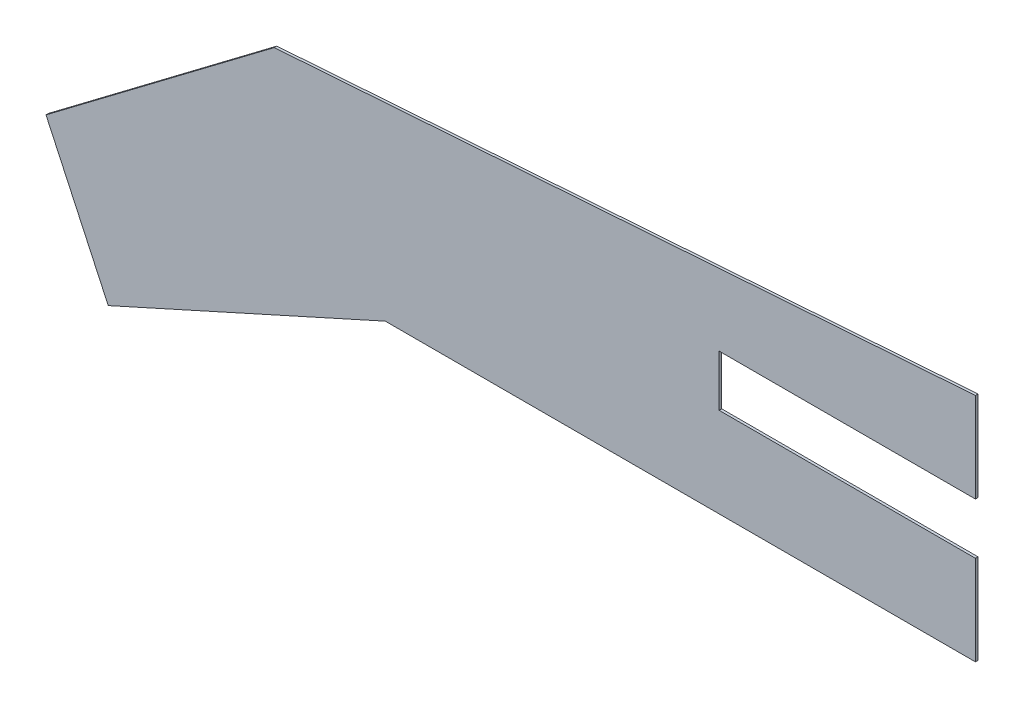
ISO-10303-21;
HEADER;
FILE_DESCRIPTION(('STEP AP214'),'2;1');
FILE_NAME('part.step','',(''),(''),'','','');
FILE_SCHEMA(('AUTOMOTIVE_DESIGN { 1 0 10303 214 1 1 1 1 }'));
ENDSEC;
DATA;
#1=APPLICATION_CONTEXT('core data for automotive mechanical design processes');
#2=APPLICATION_PROTOCOL_DEFINITION('international standard','automotive_design',2000,#1);
#3=PRODUCT_CONTEXT('',#1,'mechanical');
#4=PRODUCT('Part','Part','',(#3));
#5=PRODUCT_RELATED_PRODUCT_CATEGORY('part','',(#4));
#6=PRODUCT_DEFINITION_FORMATION('','',#4);
#7=PRODUCT_DEFINITION_CONTEXT('part definition',#1,'design');
#8=PRODUCT_DEFINITION('design','',#6,#7);
#9=PRODUCT_DEFINITION_SHAPE('','',#8);
#10=(LENGTH_UNIT() NAMED_UNIT(*) SI_UNIT(.MILLI.,.METRE.));
#11=(NAMED_UNIT(*) PLANE_ANGLE_UNIT() SI_UNIT($,.RADIAN.));
#12=(NAMED_UNIT(*) SI_UNIT($,.STERADIAN.) SOLID_ANGLE_UNIT());
#13=UNCERTAINTY_MEASURE_WITH_UNIT(LENGTH_MEASURE(1.E-05),#10,'distance_accuracy_value','');
#14=(GEOMETRIC_REPRESENTATION_CONTEXT(3) GLOBAL_UNCERTAINTY_ASSIGNED_CONTEXT((#13)) GLOBAL_UNIT_ASSIGNED_CONTEXT((#10,
#11,#12)) REPRESENTATION_CONTEXT('',''));
#15=CARTESIAN_POINT('',(0.,0.,0.));
#16=DIRECTION('',(0.,0.,1.));
#17=DIRECTION('',(1.,0.,0.));
#18=AXIS2_PLACEMENT_3D('',#15,#16,#17);
#19=CARTESIAN_POINT('',(62.5481690367757,0.,0.1));
#20=DIRECTION('',(1.,0.,0.));
#21=DIRECTION('',(0.,0.,-1.));
#22=AXIS2_PLACEMENT_3D('',#19,#20,#21);
#23=PLANE('',#22);
#24=DIRECTION('',(0.,-1.,0.));
#25=VECTOR('',#24,1.);
#26=CARTESIAN_POINT('',(62.5481690367757,0.,0.));
#27=LINE('',#26,#25);
#28=CARTESIAN_POINT('',(62.5481690367757,19.4319314431535,0.));
#29=VERTEX_POINT('',#28);
#30=CARTESIAN_POINT('',(62.5481690367757,15.9319314431535,0.));
#31=VERTEX_POINT('',#30);
#32=EDGE_CURVE('E137',#29,#31,#27,.T.);
#33=ORIENTED_EDGE('',*,*,#32,.F.);
#34=DIRECTION('',(0.,0.,-1.));
#35=VECTOR('',#34,1.);
#36=CARTESIAN_POINT('',(62.5481690367757,19.4319314431535,0.1));
#37=LINE('',#36,#35);
#38=CARTESIAN_POINT('',(62.5481690367757,19.4319314431535,0.1));
#39=VERTEX_POINT('',#38);
#40=EDGE_CURVE('E11',#39,#29,#37,.T.);
#41=ORIENTED_EDGE('',*,*,#40,.F.);
#42=DIRECTION('',(0.,-1.,0.));
#43=VECTOR('',#42,1.);
#44=CARTESIAN_POINT('',(62.5481690367757,0.,0.1));
#45=LINE('',#44,#43);
#46=CARTESIAN_POINT('',(62.5481690367757,15.9319314431535,0.1));
#47=VERTEX_POINT('',#46);
#48=EDGE_CURVE('E162',#39,#47,#45,.T.);
#49=ORIENTED_EDGE('',*,*,#48,.T.);
#50=DIRECTION('',(0.,0.,-1.));
#51=VECTOR('',#50,1.);
#52=CARTESIAN_POINT('',(62.5481690367757,15.9319314431535,0.1));
#53=LINE('',#52,#51);
#54=EDGE_CURVE('E49',#47,#31,#53,.T.);
#55=ORIENTED_EDGE('',*,*,#54,.T.);
#56=EDGE_LOOP('',(#33,#41,#49,#55));
#57=FACE_BOUND('',#56,.T.);
#58=ADVANCED_FACE('F33',(#57),#23,.T.);
#59=CARTESIAN_POINT('',(0.,19.4319314431535,0.1));
#60=DIRECTION('',(0.,1.,0.));
#61=DIRECTION('',(0.,0.,1.));
#62=AXIS2_PLACEMENT_3D('',#59,#60,#61);
#63=PLANE('',#62);
#64=DIRECTION('',(1.,0.,0.));
#65=VECTOR('',#64,1.);
#66=CARTESIAN_POINT('',(0.,19.4319314431535,0.));
#67=LINE('',#66,#65);
#68=CARTESIAN_POINT('',(52.5481690367757,19.4319314431535,0.));
#69=VERTEX_POINT('',#68);
#70=EDGE_CURVE('E139',#69,#29,#67,.T.);
#71=ORIENTED_EDGE('',*,*,#70,.F.);
#72=DIRECTION('',(0.,0.,-1.));
#73=VECTOR('',#72,1.);
#74=CARTESIAN_POINT('',(52.5481690367757,19.4319314431535,0.1));
#75=LINE('',#74,#73);
#76=CARTESIAN_POINT('',(52.5481690367757,19.4319314431535,0.1));
#77=VERTEX_POINT('',#76);
#78=EDGE_CURVE('E41',#77,#69,#75,.T.);
#79=ORIENTED_EDGE('',*,*,#78,.F.);
#80=DIRECTION('',(1.,0.,0.));
#81=VECTOR('',#80,1.);
#82=CARTESIAN_POINT('',(0.,19.4319314431535,0.1));
#83=LINE('',#82,#81);
#84=EDGE_CURVE('E197',#77,#39,#83,.T.);
#85=ORIENTED_EDGE('',*,*,#84,.T.);
#86=ORIENTED_EDGE('',*,*,#40,.T.);
#87=EDGE_LOOP('',(#71,#79,#85,#86));
#88=FACE_BOUND('',#87,.T.);
#89=ADVANCED_FACE('F184',(#88),#63,.T.);
#90=CARTESIAN_POINT('',(52.5481690367757,0.,0.1));
#91=DIRECTION('',(1.,0.,0.));
#92=DIRECTION('',(0.,0.,-1.));
#93=AXIS2_PLACEMENT_3D('',#90,#91,#92);
#94=PLANE('',#93);
#95=DIRECTION('',(0.,-1.,0.));
#96=VECTOR('',#95,1.);
#97=CARTESIAN_POINT('',(52.5481690367757,0.,0.));
#98=LINE('',#97,#96);
#99=CARTESIAN_POINT('',(52.5481690367757,21.4319314431535,0.));
#100=VERTEX_POINT('',#99);
#101=EDGE_CURVE('E142',#100,#69,#98,.T.);
#102=ORIENTED_EDGE('',*,*,#101,.F.);
#103=DIRECTION('',(0.,0.,-1.));
#104=VECTOR('',#103,1.);
#105=CARTESIAN_POINT('',(52.5481690367757,21.4319314431535,0.1));
#106=LINE('',#105,#104);
#107=CARTESIAN_POINT('',(52.5481690367757,21.4319314431535,0.1));
#108=VERTEX_POINT('',#107);
#109=EDGE_CURVE('E173',#108,#100,#106,.T.);
#110=ORIENTED_EDGE('',*,*,#109,.F.);
#111=DIRECTION('',(0.,-1.,0.));
#112=VECTOR('',#111,1.);
#113=CARTESIAN_POINT('',(52.5481690367757,0.,0.1));
#114=LINE('',#113,#112);
#115=EDGE_CURVE('E180',#108,#77,#114,.T.);
#116=ORIENTED_EDGE('',*,*,#115,.T.);
#117=ORIENTED_EDGE('',*,*,#78,.T.);
#118=EDGE_LOOP('',(#102,#110,#116,#117));
#119=FACE_BOUND('',#118,.T.);
#120=ADVANCED_FACE('F178',(#119),#94,.T.);
#121=CARTESIAN_POINT('',(0.,21.4319314431535,0.1));
#122=DIRECTION('',(0.,-1.,0.));
#123=DIRECTION('',(0.,0.,-1.));
#124=AXIS2_PLACEMENT_3D('',#121,#122,#123);
#125=PLANE('',#124);
#126=DIRECTION('',(-1.,0.,0.));
#127=VECTOR('',#126,1.);
#128=CARTESIAN_POINT('',(0.,21.4319314431535,0.));
#129=LINE('',#128,#127);
#130=CARTESIAN_POINT('',(62.5481690367757,21.4319314431535,0.));
#131=VERTEX_POINT('',#130);
#132=EDGE_CURVE('E145',#131,#100,#129,.T.);
#133=ORIENTED_EDGE('',*,*,#132,.F.);
#134=DIRECTION('',(0.,0.,-1.));
#135=VECTOR('',#134,1.);
#136=CARTESIAN_POINT('',(62.5481690367757,21.4319314431535,0.1));
#137=LINE('',#136,#135);
#138=CARTESIAN_POINT('',(62.5481690367757,21.4319314431535,0.1));
#139=VERTEX_POINT('',#138);
#140=EDGE_CURVE('E171',#139,#131,#137,.T.);
#141=ORIENTED_EDGE('',*,*,#140,.F.);
#142=DIRECTION('',(-1.,0.,0.));
#143=VECTOR('',#142,1.);
#144=CARTESIAN_POINT('',(0.,21.4319314431535,0.1));
#145=LINE('',#144,#143);
#146=EDGE_CURVE('E194',#139,#108,#145,.T.);
#147=ORIENTED_EDGE('',*,*,#146,.T.);
#148=ORIENTED_EDGE('',*,*,#109,.T.);
#149=EDGE_LOOP('',(#133,#141,#147,#148));
#150=FACE_BOUND('',#149,.T.);
#151=ADVANCED_FACE('F191',(#150),#125,.T.);
#152=CARTESIAN_POINT('',(62.5481690367757,0.,0.1));
#153=DIRECTION('',(1.,0.,0.));
#154=DIRECTION('',(0.,0.,-1.));
#155=AXIS2_PLACEMENT_3D('',#152,#153,#154);
#156=PLANE('',#155);
#157=DIRECTION('',(0.,-1.,0.));
#158=VECTOR('',#157,1.);
#159=CARTESIAN_POINT('',(62.5481690367757,0.,0.));
#160=LINE('',#159,#158);
#161=CARTESIAN_POINT('',(62.5481690367757,24.9319314431535,0.));
#162=VERTEX_POINT('',#161);
#163=EDGE_CURVE('E148',#162,#131,#160,.T.);
#164=ORIENTED_EDGE('',*,*,#163,.F.);
#165=DIRECTION('',(0.,0.,-1.));
#166=VECTOR('',#165,1.);
#167=CARTESIAN_POINT('',(62.5481690367757,24.9319314431535,0.1));
#168=LINE('',#167,#166);
#169=CARTESIAN_POINT('',(62.5481690367757,24.9319314431535,0.1));
#170=VERTEX_POINT('',#169);
#171=EDGE_CURVE('E169',#170,#162,#168,.T.);
#172=ORIENTED_EDGE('',*,*,#171,.F.);
#173=DIRECTION('',(0.,-1.,0.));
#174=VECTOR('',#173,1.);
#175=CARTESIAN_POINT('',(62.5481690367757,0.,0.1));
#176=LINE('',#175,#174);
#177=EDGE_CURVE('E199',#170,#139,#176,.T.);
#178=ORIENTED_EDGE('',*,*,#177,.T.);
#179=ORIENTED_EDGE('',*,*,#140,.T.);
#180=EDGE_LOOP('',(#164,#172,#178,#179));
#181=FACE_BOUND('',#180,.T.);
#182=ADVANCED_FACE('F234',(#181),#156,.T.);
#183=CARTESIAN_POINT('',(-1.43769166608173,20.4289025348361,0.1));
#184=DIRECTION('',(0.0702017453382749,-0.997532813972282,0.));
#185=DIRECTION('',(0.997532813972282,0.0702017453382749,0.));
#186=AXIS2_PLACEMENT_3D('',#183,#184,#185);
#187=PLANE('',#186);
#188=DIRECTION('',(-0.997532813972282,-0.0702017453382749,0.));
#189=VECTOR('',#188,1.);
#190=CARTESIAN_POINT('',(-1.43769166608173,20.4289025348361,0.));
#191=LINE('',#190,#189);
#192=CARTESIAN_POINT('',(35.1968416958444,23.0070715390409,0.));
#193=VERTEX_POINT('',#192);
#194=EDGE_CURVE('E151',#162,#193,#191,.T.);
#195=ORIENTED_EDGE('',*,*,#194,.T.);
#196=DIRECTION('',(0.,0.,-1.));
#197=VECTOR('',#196,1.);
#198=CARTESIAN_POINT('',(35.1968416958444,23.0070715390409,0.1));
#199=LINE('',#198,#197);
#200=CARTESIAN_POINT('',(35.1968416958444,23.0070715390409,0.1));
#201=VERTEX_POINT('',#200);
#202=EDGE_CURVE('E166',#201,#193,#199,.T.);
#203=ORIENTED_EDGE('',*,*,#202,.F.);
#204=DIRECTION('',(-0.997532813972282,-0.0702017453382749,0.));
#205=VECTOR('',#204,1.);
#206=CARTESIAN_POINT('',(-1.43769166608173,20.4289025348361,0.1));
#207=LINE('',#206,#205);
#208=EDGE_CURVE('E205',#170,#201,#207,.T.);
#209=ORIENTED_EDGE('',*,*,#208,.F.);
#210=ORIENTED_EDGE('',*,*,#171,.T.);
#211=EDGE_LOOP('',(#195,#203,#209,#210));
#212=FACE_BOUND('',#211,.T.);
#213=ADVANCED_FACE('F209',(#212),#187,.F.);
#214=CARTESIAN_POINT('',(1.72061836601219,-2.27801493737286,0.1));
#215=DIRECTION('',(0.602710777432995,-0.797959722521203,0.));
#216=DIRECTION('',(0.797959722521203,0.602710777432995,0.));
#217=AXIS2_PLACEMENT_3D('',#214,#215,#216);
#218=PLANE('',#217);
#219=DIRECTION('',(-0.797959722521203,-0.602710777432995,0.));
#220=VECTOR('',#219,1.);
#221=CARTESIAN_POINT('',(1.72061836601219,-2.27801493737286,0.));
#222=LINE('',#221,#220);
#223=CARTESIAN_POINT('',(26.2950876708367,16.2834450983754,0.));
#224=VERTEX_POINT('',#223);
#225=EDGE_CURVE('E153',#193,#224,#222,.T.);
#226=ORIENTED_EDGE('',*,*,#225,.T.);
#227=DIRECTION('',(0.,0.,-1.));
#228=VECTOR('',#227,1.);
#229=CARTESIAN_POINT('',(26.2950876708367,16.2834450983754,0.1));
#230=LINE('',#229,#228);
#231=CARTESIAN_POINT('',(26.2950876708367,16.2834450983754,0.1));
#232=VERTEX_POINT('',#231);
#233=EDGE_CURVE('E120',#232,#224,#230,.T.);
#234=ORIENTED_EDGE('',*,*,#233,.F.);
#235=DIRECTION('',(-0.797959722521203,-0.602710777432995,0.));
#236=VECTOR('',#235,1.);
#237=CARTESIAN_POINT('',(1.72061836601219,-2.27801493737286,0.1));
#238=LINE('',#237,#236);
#239=EDGE_CURVE('E128',#201,#232,#238,.T.);
#240=ORIENTED_EDGE('',*,*,#239,.F.);
#241=ORIENTED_EDGE('',*,*,#202,.T.);
#242=EDGE_LOOP('',(#226,#234,#240,#241));
#243=FACE_BOUND('',#242,.T.);
#244=ADVANCED_FACE('F212',(#243),#218,.F.);
#245=CARTESIAN_POINT('',(27.8515736740057,12.9309877828253,0.1));
#246=DIRECTION('',(-0.90701021153305,-0.421108627523554,0.));
#247=DIRECTION('',(0.421108627523554,-0.90701021153305,0.));
#248=AXIS2_PLACEMENT_3D('',#245,#246,#247);
#249=PLANE('',#248);
#250=DIRECTION('',(-0.421108627523554,0.90701021153305,0.));
#251=VECTOR('',#250,1.);
#252=CARTESIAN_POINT('',(27.8515736740057,12.9309877828253,0.));
#253=LINE('',#252,#251);
#254=CARTESIAN_POINT('',(28.7226728101831,11.0547597501278,0.));
#255=VERTEX_POINT('',#254);
#256=EDGE_CURVE('E116',#255,#224,#253,.T.);
#257=ORIENTED_EDGE('',*,*,#256,.F.);
#258=DIRECTION('',(0.,0.,-1.));
#259=VECTOR('',#258,1.);
#260=CARTESIAN_POINT('',(28.7226728101831,11.0547597501278,0.1));
#261=LINE('',#260,#259);
#262=CARTESIAN_POINT('',(28.7226728101831,11.0547597501278,0.1));
#263=VERTEX_POINT('',#262);
#264=EDGE_CURVE('E111',#263,#255,#261,.T.);
#265=ORIENTED_EDGE('',*,*,#264,.F.);
#266=DIRECTION('',(-0.421108627523554,0.90701021153305,0.));
#267=VECTOR('',#266,1.);
#268=CARTESIAN_POINT('',(27.8515736740057,12.9309877828253,0.1));
#269=LINE('',#268,#267);
#270=EDGE_CURVE('E114',#263,#232,#269,.T.);
#271=ORIENTED_EDGE('',*,*,#270,.T.);
#272=ORIENTED_EDGE('',*,*,#233,.T.);
#273=EDGE_LOOP('',(#257,#265,#271,#272));
#274=FACE_BOUND('',#273,.T.);
#275=ADVANCED_FACE('F113',(#274),#249,.T.);
#276=CARTESIAN_POINT('',(0.715408479979038,-1.58518384599364,0.1));
#277=DIRECTION('',(0.411356989318595,-0.911474315238088,0.));
#278=DIRECTION('',(0.911474315238088,0.411356989318595,0.));
#279=AXIS2_PLACEMENT_3D('',#276,#277,#278);
#280=PLANE('',#279);
#281=DIRECTION('',(-0.911474315238088,-0.411356989318595,0.));
#282=VECTOR('',#281,1.);
#283=CARTESIAN_POINT('',(0.715408479979038,-1.58518384599364,0.));
#284=LINE('',#283,#282);
#285=CARTESIAN_POINT('',(39.5293853363588,15.9319314431535,0.));
#286=VERTEX_POINT('',#285);
#287=EDGE_CURVE('E157',#286,#255,#284,.T.);
#288=ORIENTED_EDGE('',*,*,#287,.F.);
#289=DIRECTION('',(0.,0.,-1.));
#290=VECTOR('',#289,1.);
#291=CARTESIAN_POINT('',(39.5293853363588,15.9319314431535,0.1));
#292=LINE('',#291,#290);
#293=CARTESIAN_POINT('',(39.5293853363588,15.9319314431535,0.1));
#294=VERTEX_POINT('',#293);
#295=EDGE_CURVE('E80',#294,#286,#292,.T.);
#296=ORIENTED_EDGE('',*,*,#295,.F.);
#297=DIRECTION('',(-0.911474315238088,-0.411356989318595,0.));
#298=VECTOR('',#297,1.);
#299=CARTESIAN_POINT('',(0.715408479979038,-1.58518384599364,0.1));
#300=LINE('',#299,#298);
#301=EDGE_CURVE('E126',#294,#263,#300,.T.);
#302=ORIENTED_EDGE('',*,*,#301,.T.);
#303=ORIENTED_EDGE('',*,*,#264,.T.);
#304=EDGE_LOOP('',(#288,#296,#302,#303));
#305=FACE_BOUND('',#304,.T.);
#306=ADVANCED_FACE('F131',(#305),#280,.T.);
#307=CARTESIAN_POINT('',(0.,15.9319314431535,0.1));
#308=DIRECTION('',(0.,-1.,0.));
#309=DIRECTION('',(0.,0.,-1.));
#310=AXIS2_PLACEMENT_3D('',#307,#308,#309);
#311=PLANE('',#310);
#312=DIRECTION('',(-1.,0.,0.));
#313=VECTOR('',#312,1.);
#314=CARTESIAN_POINT('',(0.,15.9319314431535,0.));
#315=LINE('',#314,#313);
#316=EDGE_CURVE('E159',#31,#286,#315,.T.);
#317=ORIENTED_EDGE('',*,*,#316,.F.);
#318=ORIENTED_EDGE('',*,*,#54,.F.);
#319=DIRECTION('',(-1.,0.,0.));
#320=VECTOR('',#319,1.);
#321=CARTESIAN_POINT('',(0.,15.9319314431535,0.1));
#322=LINE('',#321,#320);
#323=EDGE_CURVE('E132',#47,#294,#322,.T.);
#324=ORIENTED_EDGE('',*,*,#323,.T.);
#325=ORIENTED_EDGE('',*,*,#295,.T.);
#326=EDGE_LOOP('',(#317,#318,#324,#325));
#327=FACE_BOUND('',#326,.T.);
#328=ADVANCED_FACE('F213',(#327),#311,.T.);
#329=CARTESIAN_POINT('',(0.,0.,0.1));
#330=DIRECTION('',(0.,0.,1.));
#331=DIRECTION('',(1.,0.,0.));
#332=AXIS2_PLACEMENT_3D('',#329,#330,#331);
#333=PLANE('',#332);
#334=ORIENTED_EDGE('',*,*,#48,.F.);
#335=ORIENTED_EDGE('',*,*,#84,.F.);
#336=ORIENTED_EDGE('',*,*,#115,.F.);
#337=ORIENTED_EDGE('',*,*,#146,.F.);
#338=ORIENTED_EDGE('',*,*,#177,.F.);
#339=ORIENTED_EDGE('',*,*,#208,.T.);
#340=ORIENTED_EDGE('',*,*,#239,.T.);
#341=ORIENTED_EDGE('',*,*,#270,.F.);
#342=ORIENTED_EDGE('',*,*,#301,.F.);
#343=ORIENTED_EDGE('',*,*,#323,.F.);
#344=EDGE_LOOP('',(#334,#335,#336,#337,#338,#339,#340,#341,#342,#343));
#345=FACE_BOUND('',#344,.T.);
#346=ADVANCED_FACE('F124',(#345),#333,.T.);
#347=CARTESIAN_POINT('',(0.,0.,0.));
#348=DIRECTION('',(0.,0.,1.));
#349=DIRECTION('',(1.,0.,0.));
#350=AXIS2_PLACEMENT_3D('',#347,#348,#349);
#351=PLANE('',#350);
#352=ORIENTED_EDGE('',*,*,#32,.T.);
#353=ORIENTED_EDGE('',*,*,#316,.T.);
#354=ORIENTED_EDGE('',*,*,#287,.T.);
#355=ORIENTED_EDGE('',*,*,#256,.T.);
#356=ORIENTED_EDGE('',*,*,#225,.F.);
#357=ORIENTED_EDGE('',*,*,#194,.F.);
#358=ORIENTED_EDGE('',*,*,#163,.T.);
#359=ORIENTED_EDGE('',*,*,#132,.T.);
#360=ORIENTED_EDGE('',*,*,#101,.T.);
#361=ORIENTED_EDGE('',*,*,#70,.T.);
#362=EDGE_LOOP('',(#352,#353,#354,#355,#356,#357,#358,#359,#360,#361));
#363=FACE_BOUND('',#362,.T.);
#364=ADVANCED_FACE('F186',(#363),#351,.F.);
#365=CLOSED_SHELL('',(#58,#89,#120,#151,#182,#213,#244,#275,#306,#328,#346,#364));
#366=MANIFOLD_SOLID_BREP('B2',#365);
#367=ADVANCED_BREP_SHAPE_REPRESENTATION('',(#18,#366),#14);
#368=SHAPE_DEFINITION_REPRESENTATION(#9,#367);
ENDSEC;
END-ISO-10303-21;
